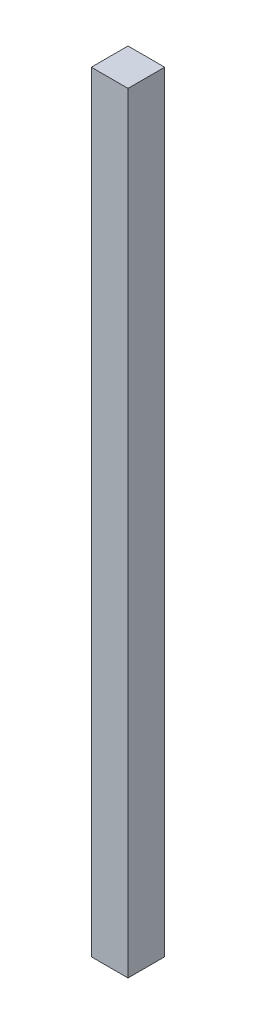
ISO-10303-21;
HEADER;
FILE_DESCRIPTION(('STEP AP214'),'2;1');
FILE_NAME('part.step','',(''),(''),'','','');
FILE_SCHEMA(('AUTOMOTIVE_DESIGN { 1 0 10303 214 1 1 1 1 }'));
ENDSEC;
DATA;
#1=APPLICATION_CONTEXT('core data for automotive mechanical design processes');
#2=APPLICATION_PROTOCOL_DEFINITION('international standard','automotive_design',2000,#1);
#3=PRODUCT_CONTEXT('',#1,'mechanical');
#4=PRODUCT('Part','Part','',(#3));
#5=PRODUCT_RELATED_PRODUCT_CATEGORY('part','',(#4));
#6=PRODUCT_DEFINITION_FORMATION('','',#4);
#7=PRODUCT_DEFINITION_CONTEXT('part definition',#1,'design');
#8=PRODUCT_DEFINITION('design','',#6,#7);
#9=PRODUCT_DEFINITION_SHAPE('','',#8);
#10=(LENGTH_UNIT() NAMED_UNIT(*) SI_UNIT(.MILLI.,.METRE.));
#11=(NAMED_UNIT(*) PLANE_ANGLE_UNIT() SI_UNIT($,.RADIAN.));
#12=(NAMED_UNIT(*) SI_UNIT($,.STERADIAN.) SOLID_ANGLE_UNIT());
#13=UNCERTAINTY_MEASURE_WITH_UNIT(LENGTH_MEASURE(1.E-05),#10,'distance_accuracy_value','');
#14=(GEOMETRIC_REPRESENTATION_CONTEXT(3) GLOBAL_UNCERTAINTY_ASSIGNED_CONTEXT((#13)) GLOBAL_UNIT_ASSIGNED_CONTEXT((#10,
#11,#12)) REPRESENTATION_CONTEXT('',''));
#15=CARTESIAN_POINT('',(0.,0.,0.));
#16=DIRECTION('',(0.,0.,1.));
#17=DIRECTION('',(1.,0.,0.));
#18=AXIS2_PLACEMENT_3D('',#15,#16,#17);
#19=CARTESIAN_POINT('',(0.,420.,0.));
#20=DIRECTION('',(1.,0.,0.));
#21=DIRECTION('',(0.,0.,-1.));
#22=AXIS2_PLACEMENT_3D('',#19,#20,#21);
#23=PLANE('',#22);
#24=DIRECTION('',(0.,0.,1.));
#25=VECTOR('',#24,1.);
#26=CARTESIAN_POINT('',(0.,0.,0.));
#27=LINE('',#26,#25);
#28=CARTESIAN_POINT('',(0.,0.,0.));
#29=VERTEX_POINT('',#28);
#30=CARTESIAN_POINT('',(0.,0.,20.));
#31=VERTEX_POINT('',#30);
#32=EDGE_CURVE('E95',#29,#31,#27,.T.);
#33=ORIENTED_EDGE('',*,*,#32,.T.);
#34=DIRECTION('',(0.,-1.,0.));
#35=VECTOR('',#34,1.);
#36=CARTESIAN_POINT('',(0.,420.,20.));
#37=LINE('',#36,#35);
#38=CARTESIAN_POINT('',(0.,420.,20.));
#39=VERTEX_POINT('',#38);
#40=EDGE_CURVE('E11',#39,#31,#37,.T.);
#41=ORIENTED_EDGE('',*,*,#40,.F.);
#42=DIRECTION('',(0.,0.,1.));
#43=VECTOR('',#42,1.);
#44=CARTESIAN_POINT('',(0.,420.,0.));
#45=LINE('',#44,#43);
#46=CARTESIAN_POINT('',(0.,420.,0.));
#47=VERTEX_POINT('',#46);
#48=EDGE_CURVE('E83',#47,#39,#45,.T.);
#49=ORIENTED_EDGE('',*,*,#48,.F.);
#50=DIRECTION('',(0.,-1.,0.));
#51=VECTOR('',#50,1.);
#52=CARTESIAN_POINT('',(0.,420.,0.));
#53=LINE('',#52,#51);
#54=EDGE_CURVE('E91',#47,#29,#53,.T.);
#55=ORIENTED_EDGE('',*,*,#54,.T.);
#56=EDGE_LOOP('',(#33,#41,#49,#55));
#57=FACE_BOUND('',#56,.T.);
#58=ADVANCED_FACE('F32',(#57),#23,.F.);
#59=CARTESIAN_POINT('',(0.,420.,20.));
#60=DIRECTION('',(0.,0.,-1.));
#61=DIRECTION('',(-1.,0.,0.));
#62=AXIS2_PLACEMENT_3D('',#59,#60,#61);
#63=PLANE('',#62);
#64=DIRECTION('',(1.,0.,0.));
#65=VECTOR('',#64,1.);
#66=CARTESIAN_POINT('',(0.,0.,20.));
#67=LINE('',#66,#65);
#68=CARTESIAN_POINT('',(20.,0.,20.));
#69=VERTEX_POINT('',#68);
#70=EDGE_CURVE('E87',#31,#69,#67,.T.);
#71=ORIENTED_EDGE('',*,*,#70,.T.);
#72=DIRECTION('',(0.,-1.,0.));
#73=VECTOR('',#72,1.);
#74=CARTESIAN_POINT('',(20.,420.,20.));
#75=LINE('',#74,#73);
#76=CARTESIAN_POINT('',(20.,420.,20.));
#77=VERTEX_POINT('',#76);
#78=EDGE_CURVE('E40',#77,#69,#75,.T.);
#79=ORIENTED_EDGE('',*,*,#78,.F.);
#80=DIRECTION('',(1.,0.,0.));
#81=VECTOR('',#80,1.);
#82=CARTESIAN_POINT('',(0.,420.,20.));
#83=LINE('',#82,#81);
#84=EDGE_CURVE('E78',#39,#77,#83,.T.);
#85=ORIENTED_EDGE('',*,*,#84,.F.);
#86=ORIENTED_EDGE('',*,*,#40,.T.);
#87=EDGE_LOOP('',(#71,#79,#85,#86));
#88=FACE_BOUND('',#87,.T.);
#89=ADVANCED_FACE('F86',(#88),#63,.F.);
#90=CARTESIAN_POINT('',(20.,420.,0.));
#91=DIRECTION('',(-1.,0.,0.));
#92=DIRECTION('',(0.,0.,1.));
#93=AXIS2_PLACEMENT_3D('',#90,#91,#92);
#94=PLANE('',#93);
#95=DIRECTION('',(0.,0.,-1.));
#96=VECTOR('',#95,1.);
#97=CARTESIAN_POINT('',(20.,0.,0.));
#98=LINE('',#97,#96);
#99=CARTESIAN_POINT('',(20.,0.,0.));
#100=VERTEX_POINT('',#99);
#101=EDGE_CURVE('E65',#69,#100,#98,.T.);
#102=ORIENTED_EDGE('',*,*,#101,.T.);
#103=DIRECTION('',(0.,-1.,0.));
#104=VECTOR('',#103,1.);
#105=CARTESIAN_POINT('',(20.,420.,0.));
#106=LINE('',#105,#104);
#107=CARTESIAN_POINT('',(20.,420.,0.));
#108=VERTEX_POINT('',#107);
#109=EDGE_CURVE('E88',#108,#100,#106,.T.);
#110=ORIENTED_EDGE('',*,*,#109,.F.);
#111=DIRECTION('',(0.,0.,-1.));
#112=VECTOR('',#111,1.);
#113=CARTESIAN_POINT('',(20.,420.,0.));
#114=LINE('',#113,#112);
#115=EDGE_CURVE('E81',#77,#108,#114,.T.);
#116=ORIENTED_EDGE('',*,*,#115,.F.);
#117=ORIENTED_EDGE('',*,*,#78,.T.);
#118=EDGE_LOOP('',(#102,#110,#116,#117));
#119=FACE_BOUND('',#118,.T.);
#120=ADVANCED_FACE('F89',(#119),#94,.F.);
#121=CARTESIAN_POINT('',(0.,420.,0.));
#122=DIRECTION('',(0.,0.,1.));
#123=DIRECTION('',(1.,0.,0.));
#124=AXIS2_PLACEMENT_3D('',#121,#122,#123);
#125=PLANE('',#124);
#126=DIRECTION('',(-1.,0.,0.));
#127=VECTOR('',#126,1.);
#128=CARTESIAN_POINT('',(0.,0.,0.));
#129=LINE('',#128,#127);
#130=EDGE_CURVE('E71',#100,#29,#129,.T.);
#131=ORIENTED_EDGE('',*,*,#130,.T.);
#132=ORIENTED_EDGE('',*,*,#54,.F.);
#133=DIRECTION('',(-1.,0.,0.));
#134=VECTOR('',#133,1.);
#135=CARTESIAN_POINT('',(0.,420.,0.));
#136=LINE('',#135,#134);
#137=EDGE_CURVE('E48',#108,#47,#136,.T.);
#138=ORIENTED_EDGE('',*,*,#137,.F.);
#139=ORIENTED_EDGE('',*,*,#109,.T.);
#140=EDGE_LOOP('',(#131,#132,#138,#139));
#141=FACE_BOUND('',#140,.T.);
#142=ADVANCED_FACE('F102',(#141),#125,.F.);
#143=CARTESIAN_POINT('',(0.,420.,0.));
#144=DIRECTION('',(0.,1.,0.));
#145=DIRECTION('',(0.,0.,1.));
#146=AXIS2_PLACEMENT_3D('',#143,#144,#145);
#147=PLANE('',#146);
#148=ORIENTED_EDGE('',*,*,#48,.T.);
#149=ORIENTED_EDGE('',*,*,#84,.T.);
#150=ORIENTED_EDGE('',*,*,#115,.T.);
#151=ORIENTED_EDGE('',*,*,#137,.T.);
#152=EDGE_LOOP('',(#148,#149,#150,#151));
#153=FACE_BOUND('',#152,.T.);
#154=ADVANCED_FACE('F79',(#153),#147,.T.);
#155=CARTESIAN_POINT('',(0.,0.,0.));
#156=DIRECTION('',(0.,1.,0.));
#157=DIRECTION('',(0.,0.,1.));
#158=AXIS2_PLACEMENT_3D('',#155,#156,#157);
#159=PLANE('',#158);
#160=ORIENTED_EDGE('',*,*,#32,.F.);
#161=ORIENTED_EDGE('',*,*,#130,.F.);
#162=ORIENTED_EDGE('',*,*,#101,.F.);
#163=ORIENTED_EDGE('',*,*,#70,.F.);
#164=EDGE_LOOP('',(#160,#161,#162,#163));
#165=FACE_BOUND('',#164,.T.);
#166=ADVANCED_FACE('F105',(#165),#159,.F.);
#167=CLOSED_SHELL('',(#58,#89,#120,#142,#154,#166));
#168=MANIFOLD_SOLID_BREP('B2',#167);
#169=ADVANCED_BREP_SHAPE_REPRESENTATION('',(#18,#168),#14);
#170=SHAPE_DEFINITION_REPRESENTATION(#9,#169);
ENDSEC;
END-ISO-10303-21;
